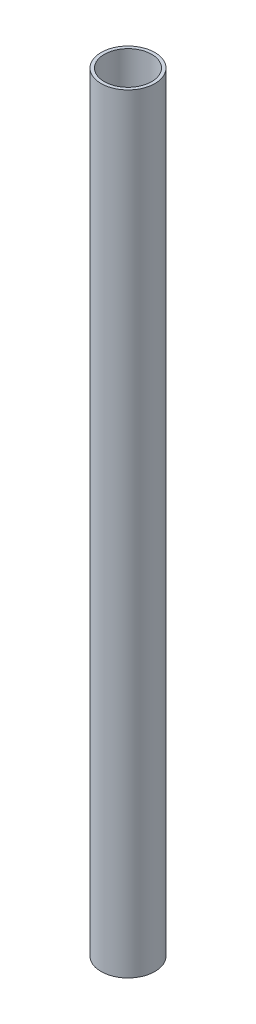
ISO-10303-21;
HEADER;
FILE_DESCRIPTION(('STEP AP214'),'2;1');
FILE_NAME('part.step','',(''),(''),'','','');
FILE_SCHEMA(('AUTOMOTIVE_DESIGN { 1 0 10303 214 1 1 1 1 }'));
ENDSEC;
DATA;
#1=APPLICATION_CONTEXT('core data for automotive mechanical design processes');
#2=APPLICATION_PROTOCOL_DEFINITION('international standard','automotive_design',2000,#1);
#3=PRODUCT_CONTEXT('',#1,'mechanical');
#4=PRODUCT('Part','Part','',(#3));
#5=PRODUCT_RELATED_PRODUCT_CATEGORY('part','',(#4));
#6=PRODUCT_DEFINITION_FORMATION('','',#4);
#7=PRODUCT_DEFINITION_CONTEXT('part definition',#1,'design');
#8=PRODUCT_DEFINITION('design','',#6,#7);
#9=PRODUCT_DEFINITION_SHAPE('','',#8);
#10=(LENGTH_UNIT() NAMED_UNIT(*) SI_UNIT(.MILLI.,.METRE.));
#11=(NAMED_UNIT(*) PLANE_ANGLE_UNIT() SI_UNIT($,.RADIAN.));
#12=(NAMED_UNIT(*) SI_UNIT($,.STERADIAN.) SOLID_ANGLE_UNIT());
#13=UNCERTAINTY_MEASURE_WITH_UNIT(LENGTH_MEASURE(1.E-05),#10,'distance_accuracy_value','');
#14=(GEOMETRIC_REPRESENTATION_CONTEXT(3) GLOBAL_UNCERTAINTY_ASSIGNED_CONTEXT((#13)) GLOBAL_UNIT_ASSIGNED_CONTEXT((#10,
#11,#12)) REPRESENTATION_CONTEXT('',''));
#15=CARTESIAN_POINT('',(0.,0.,0.));
#16=DIRECTION('',(0.,0.,1.));
#17=DIRECTION('',(1.,0.,0.));
#18=AXIS2_PLACEMENT_3D('',#15,#16,#17);
#19=CARTESIAN_POINT('',(0.,300.,0.));
#20=DIRECTION('',(0.,1.,0.));
#21=DIRECTION('',(0.,0.,1.));
#22=AXIS2_PLACEMENT_3D('',#19,#20,#21);
#23=PLANE('',#22);
#24=CARTESIAN_POINT('',(0.,300.,0.));
#25=DIRECTION('',(0.,1.,0.));
#26=DIRECTION('',(0.,0.,1.));
#27=AXIS2_PLACEMENT_3D('',#24,#25,#26);
#28=CIRCLE('',#27,10.5);
#29=CARTESIAN_POINT('',(0.,300.,10.5));
#30=VERTEX_POINT('',#29);
#31=EDGE_CURVE('E10',#30,#30,#28,.T.);
#32=ORIENTED_EDGE('',*,*,#31,.T.);
#33=EDGE_LOOP('',(#32));
#34=FACE_BOUND('',#33,.T.);
#35=CARTESIAN_POINT('',(0.,300.,0.));
#36=DIRECTION('',(0.,1.,0.));
#37=DIRECTION('',(0.,0.,1.));
#38=AXIS2_PLACEMENT_3D('',#35,#36,#37);
#39=CIRCLE('',#38,9.25);
#40=CARTESIAN_POINT('',(0.,300.,9.25));
#41=VERTEX_POINT('',#40);
#42=EDGE_CURVE('E45',#41,#41,#39,.T.);
#43=ORIENTED_EDGE('',*,*,#42,.F.);
#44=EDGE_LOOP('',(#43));
#45=FACE_BOUND('',#44,.T.);
#46=ADVANCED_FACE('F34',(#34,#45),#23,.T.);
#47=CARTESIAN_POINT('',(0.,0.,0.));
#48=DIRECTION('',(0.,1.,0.));
#49=DIRECTION('',(0.,0.,1.));
#50=AXIS2_PLACEMENT_3D('',#47,#48,#49);
#51=PLANE('',#50);
#52=CARTESIAN_POINT('',(0.,0.,0.));
#53=DIRECTION('',(0.,1.,0.));
#54=DIRECTION('',(0.,0.,1.));
#55=AXIS2_PLACEMENT_3D('',#52,#53,#54);
#56=CIRCLE('',#55,10.5);
#57=CARTESIAN_POINT('',(0.,0.,10.5));
#58=VERTEX_POINT('',#57);
#59=EDGE_CURVE('E38',#58,#58,#56,.T.);
#60=ORIENTED_EDGE('',*,*,#59,.F.);
#61=EDGE_LOOP('',(#60));
#62=FACE_BOUND('',#61,.T.);
#63=CARTESIAN_POINT('',(0.,0.,0.));
#64=DIRECTION('',(0.,1.,0.));
#65=DIRECTION('',(0.,0.,1.));
#66=AXIS2_PLACEMENT_3D('',#63,#64,#65);
#67=CIRCLE('',#66,9.25);
#68=CARTESIAN_POINT('',(0.,0.,9.25));
#69=VERTEX_POINT('',#68);
#70=EDGE_CURVE('E47',#69,#69,#67,.T.);
#71=ORIENTED_EDGE('',*,*,#70,.T.);
#72=EDGE_LOOP('',(#71));
#73=FACE_BOUND('',#72,.T.);
#74=ADVANCED_FACE('F57',(#62,#73),#51,.F.);
#75=CARTESIAN_POINT('',(0.,300.,0.));
#76=DIRECTION('',(0.,-1.,0.));
#77=DIRECTION('',(0.,0.,-1.));
#78=AXIS2_PLACEMENT_3D('',#75,#76,#77);
#79=CYLINDRICAL_SURFACE('',#78,10.5);
#80=ORIENTED_EDGE('',*,*,#31,.F.);
#81=EDGE_LOOP('',(#80));
#82=FACE_BOUND('',#81,.T.);
#83=ORIENTED_EDGE('',*,*,#59,.T.);
#84=EDGE_LOOP('',(#83));
#85=FACE_BOUND('',#84,.T.);
#86=ADVANCED_FACE('F36',(#82,#85),#79,.T.);
#87=CARTESIAN_POINT('',(0.,300.,0.));
#88=DIRECTION('',(0.,-1.,0.));
#89=DIRECTION('',(0.,0.,-1.));
#90=AXIS2_PLACEMENT_3D('',#87,#88,#89);
#91=CYLINDRICAL_SURFACE('',#90,9.25);
#92=ORIENTED_EDGE('',*,*,#42,.T.);
#93=EDGE_LOOP('',(#92));
#94=FACE_BOUND('',#93,.T.);
#95=ORIENTED_EDGE('',*,*,#70,.F.);
#96=EDGE_LOOP('',(#95));
#97=FACE_BOUND('',#96,.T.);
#98=ADVANCED_FACE('F53',(#94,#97),#91,.F.);
#99=CLOSED_SHELL('',(#46,#74,#86,#98));
#100=MANIFOLD_SOLID_BREP('B2',#99);
#101=ADVANCED_BREP_SHAPE_REPRESENTATION('',(#18,#100),#14);
#102=SHAPE_DEFINITION_REPRESENTATION(#9,#101);
ENDSEC;
END-ISO-10303-21;
